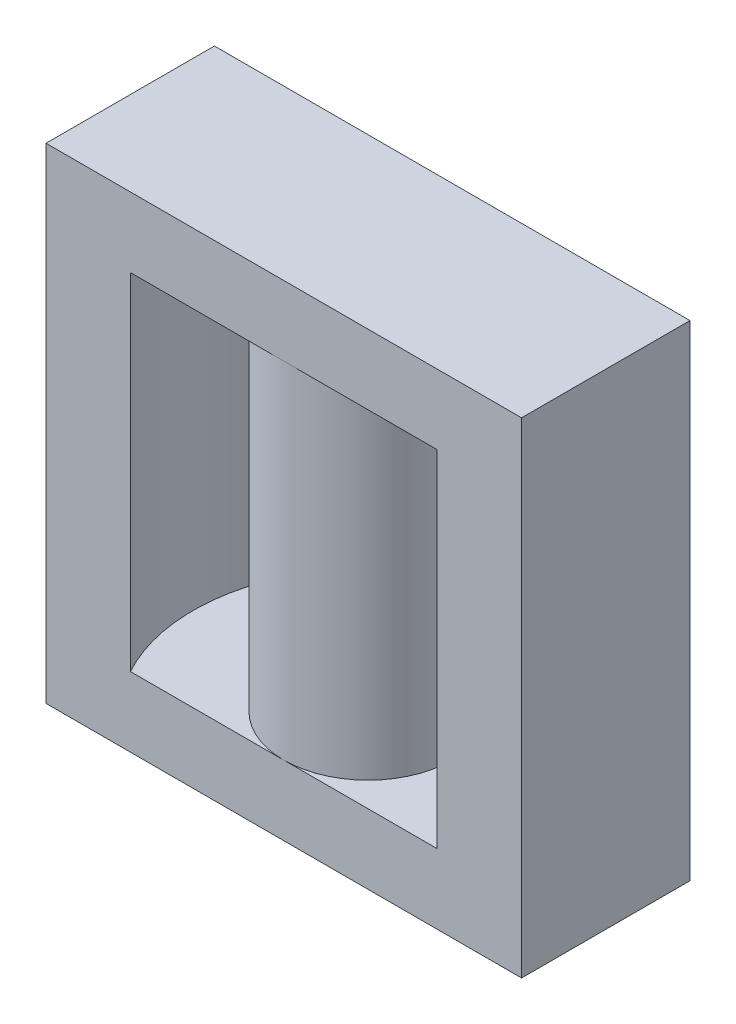
ISO-10303-21;
HEADER;
FILE_DESCRIPTION(('STEP AP214'),'2;1');
FILE_NAME('part.step','',(''),(''),'','','');
FILE_SCHEMA(('AUTOMOTIVE_DESIGN { 1 0 10303 214 1 1 1 1 }'));
ENDSEC;
DATA;
#1=APPLICATION_CONTEXT('core data for automotive mechanical design processes');
#2=APPLICATION_PROTOCOL_DEFINITION('international standard','automotive_design',2000,#1);
#3=PRODUCT_CONTEXT('',#1,'mechanical');
#4=PRODUCT('Part','Part','',(#3));
#5=PRODUCT_RELATED_PRODUCT_CATEGORY('part','',(#4));
#6=PRODUCT_DEFINITION_FORMATION('','',#4);
#7=PRODUCT_DEFINITION_CONTEXT('part definition',#1,'design');
#8=PRODUCT_DEFINITION('design','',#6,#7);
#9=PRODUCT_DEFINITION_SHAPE('','',#8);
#10=(LENGTH_UNIT() NAMED_UNIT(*) SI_UNIT(.MILLI.,.METRE.));
#11=(NAMED_UNIT(*) PLANE_ANGLE_UNIT() SI_UNIT($,.RADIAN.));
#12=(NAMED_UNIT(*) SI_UNIT($,.STERADIAN.) SOLID_ANGLE_UNIT());
#13=UNCERTAINTY_MEASURE_WITH_UNIT(LENGTH_MEASURE(1.E-05),#10,'distance_accuracy_value','');
#14=(GEOMETRIC_REPRESENTATION_CONTEXT(3) GLOBAL_UNCERTAINTY_ASSIGNED_CONTEXT((#13)) GLOBAL_UNIT_ASSIGNED_CONTEXT((#10,
#11,#12)) REPRESENTATION_CONTEXT('',''));
#15=CARTESIAN_POINT('',(0.,0.,0.));
#16=DIRECTION('',(0.,0.,1.));
#17=DIRECTION('',(1.,0.,0.));
#18=AXIS2_PLACEMENT_3D('',#15,#16,#17);
#19=CARTESIAN_POINT('',(0.,55.6,0.));
#20=DIRECTION('',(0.,-1.,0.));
#21=DIRECTION('',(0.,0.,-1.));
#22=AXIS2_PLACEMENT_3D('',#19,#20,#21);
#23=CYLINDRICAL_SURFACE('',#22,20.05);
#24=DIRECTION('',(0.,-1.,0.));
#25=VECTOR('',#24,1.);
#26=CARTESIAN_POINT('',(-17.5749822190522,55.6,9.65));
#27=LINE('',#26,#25);
#28=CARTESIAN_POINT('',(-17.5749822190522,47.6,9.65));
#29=VERTEX_POINT('',#28);
#30=CARTESIAN_POINT('',(-17.5749822190522,8.,9.65));
#31=VERTEX_POINT('',#30);
#32=EDGE_CURVE('E131',#29,#31,#27,.T.);
#33=ORIENTED_EDGE('',*,*,#32,.T.);
#34=CARTESIAN_POINT('',(0.,8.,0.));
#35=DIRECTION('',(0.,-1.,0.));
#36=DIRECTION('',(0.,0.,-1.));
#37=AXIS2_PLACEMENT_3D('',#34,#35,#36);
#38=CIRCLE('',#37,20.05);
#39=CARTESIAN_POINT('',(-17.5749822190522,8.,-9.65));
#40=VERTEX_POINT('',#39);
#41=EDGE_CURVE('E118',#31,#40,#38,.T.);
#42=ORIENTED_EDGE('',*,*,#41,.T.);
#43=DIRECTION('',(0.,-1.,0.));
#44=VECTOR('',#43,1.);
#45=CARTESIAN_POINT('',(-17.5749822190522,55.6,-9.65));
#46=LINE('',#45,#44);
#47=CARTESIAN_POINT('',(-17.5749822190522,47.6,-9.65));
#48=VERTEX_POINT('',#47);
#49=EDGE_CURVE('E128',#48,#40,#46,.T.);
#50=ORIENTED_EDGE('',*,*,#49,.F.);
#51=CARTESIAN_POINT('',(0.,47.6,0.));
#52=DIRECTION('',(0.,1.,0.));
#53=DIRECTION('',(0.,0.,1.));
#54=AXIS2_PLACEMENT_3D('',#51,#52,#53);
#55=CIRCLE('',#54,20.05);
#56=EDGE_CURVE('E162',#48,#29,#55,.T.);
#57=ORIENTED_EDGE('',*,*,#56,.T.);
#58=EDGE_LOOP('',(#33,#42,#50,#57));
#59=FACE_BOUND('',#58,.T.);
#60=ADVANCED_FACE('F38',(#59),#23,.F.);
#61=CARTESIAN_POINT('',(0.,55.6,0.));
#62=DIRECTION('',(0.,-1.,0.));
#63=DIRECTION('',(0.,0.,-1.));
#64=AXIS2_PLACEMENT_3D('',#61,#62,#63);
#65=CYLINDRICAL_SURFACE('',#64,9.65);
#66=CARTESIAN_POINT('',(0.,47.6,0.));
#67=DIRECTION('',(0.,1.,0.));
#68=DIRECTION('',(0.,0.,1.));
#69=AXIS2_PLACEMENT_3D('',#66,#67,#68);
#70=CIRCLE('',#69,9.65);
#71=CARTESIAN_POINT('',(0.,47.6,-9.65));
#72=VERTEX_POINT('',#71);
#73=CARTESIAN_POINT('',(0.,47.6,9.65));
#74=VERTEX_POINT('',#73);
#75=EDGE_CURVE('E139',#72,#74,#70,.F.);
#76=ORIENTED_EDGE('',*,*,#75,.T.);
#77=EDGE_CURVE('E143',#74,#72,#70,.F.);
#78=ORIENTED_EDGE('',*,*,#77,.T.);
#79=EDGE_LOOP('',(#76,#78));
#80=FACE_BOUND('',#79,.T.);
#81=CARTESIAN_POINT('',(0.,8.,0.));
#82=DIRECTION('',(0.,-1.,0.));
#83=DIRECTION('',(0.,0.,-1.));
#84=AXIS2_PLACEMENT_3D('',#81,#82,#83);
#85=CIRCLE('',#84,9.65);
#86=CARTESIAN_POINT('',(0.,8.,-9.65));
#87=VERTEX_POINT('',#86);
#88=CARTESIAN_POINT('',(0.,8.,9.65));
#89=VERTEX_POINT('',#88);
#90=EDGE_CURVE('E133',#87,#89,#85,.T.);
#91=ORIENTED_EDGE('',*,*,#90,.F.);
#92=EDGE_CURVE('E51',#89,#87,#85,.T.);
#93=ORIENTED_EDGE('',*,*,#92,.F.);
#94=EDGE_LOOP('',(#91,#93));
#95=FACE_BOUND('',#94,.T.);
#96=ADVANCED_FACE('F156',(#80,#95),#65,.T.);
#97=CARTESIAN_POINT('',(0.,55.6,0.));
#98=DIRECTION('',(0.,-1.,0.));
#99=DIRECTION('',(0.,0.,-1.));
#100=AXIS2_PLACEMENT_3D('',#97,#98,#99);
#101=CYLINDRICAL_SURFACE('',#100,20.05);
#102=DIRECTION('',(0.,-1.,0.));
#103=VECTOR('',#102,1.);
#104=CARTESIAN_POINT('',(17.5749822190522,55.6,-9.65));
#105=LINE('',#104,#103);
#106=CARTESIAN_POINT('',(17.5749822190522,47.6,-9.65));
#107=VERTEX_POINT('',#106);
#108=CARTESIAN_POINT('',(17.5749822190522,8.,-9.65));
#109=VERTEX_POINT('',#108);
#110=EDGE_CURVE('E59',#107,#109,#105,.T.);
#111=ORIENTED_EDGE('',*,*,#110,.T.);
#112=CARTESIAN_POINT('',(0.,8.,0.));
#113=DIRECTION('',(0.,-1.,0.));
#114=DIRECTION('',(0.,0.,-1.));
#115=AXIS2_PLACEMENT_3D('',#112,#113,#114);
#116=CIRCLE('',#115,20.05);
#117=CARTESIAN_POINT('',(17.5749822190522,8.,9.65));
#118=VERTEX_POINT('',#117);
#119=EDGE_CURVE('E11',#109,#118,#116,.T.);
#120=ORIENTED_EDGE('',*,*,#119,.T.);
#121=DIRECTION('',(0.,-1.,0.));
#122=VECTOR('',#121,1.);
#123=CARTESIAN_POINT('',(17.5749822190522,55.6,9.65));
#124=LINE('',#123,#122);
#125=CARTESIAN_POINT('',(17.5749822190522,47.6,9.65));
#126=VERTEX_POINT('',#125);
#127=EDGE_CURVE('E173',#126,#118,#124,.T.);
#128=ORIENTED_EDGE('',*,*,#127,.F.);
#129=CARTESIAN_POINT('',(0.,47.6,0.));
#130=DIRECTION('',(0.,1.,0.));
#131=DIRECTION('',(0.,0.,1.));
#132=AXIS2_PLACEMENT_3D('',#129,#130,#131);
#133=CIRCLE('',#132,20.05);
#134=EDGE_CURVE('E45',#107,#126,#133,.F.);
#135=ORIENTED_EDGE('',*,*,#134,.F.);
#136=EDGE_LOOP('',(#111,#120,#128,#135));
#137=FACE_BOUND('',#136,.T.);
#138=ADVANCED_FACE('F218',(#137),#101,.F.);
#139=CARTESIAN_POINT('',(0.,47.6,0.));
#140=DIRECTION('',(0.,1.,0.));
#141=DIRECTION('',(0.,0.,1.));
#142=AXIS2_PLACEMENT_3D('',#139,#140,#141);
#143=PLANE('',#142);
#144=ORIENTED_EDGE('',*,*,#77,.F.);
#145=DIRECTION('',(1.,0.,0.));
#146=VECTOR('',#145,1.);
#147=CARTESIAN_POINT('',(-27.25,47.6,9.65));
#148=LINE('',#147,#146);
#149=EDGE_CURVE('E161',#29,#74,#148,.T.);
#150=ORIENTED_EDGE('',*,*,#149,.F.);
#151=ORIENTED_EDGE('',*,*,#56,.F.);
#152=DIRECTION('',(-1.,0.,0.));
#153=VECTOR('',#152,1.);
#154=CARTESIAN_POINT('',(-27.25,47.6,-9.65));
#155=LINE('',#154,#153);
#156=EDGE_CURVE('E138',#72,#48,#155,.T.);
#157=ORIENTED_EDGE('',*,*,#156,.F.);
#158=EDGE_LOOP('',(#144,#150,#151,#157));
#159=FACE_BOUND('',#158,.T.);
#160=ADVANCED_FACE('F160',(#159),#143,.F.);
#161=CARTESIAN_POINT('',(0.,55.6,-9.65));
#162=DIRECTION('',(0.,0.,-1.));
#163=DIRECTION('',(-1.,0.,0.));
#164=AXIS2_PLACEMENT_3D('',#161,#162,#163);
#165=PLANE('',#164);
#166=ORIENTED_EDGE('',*,*,#49,.T.);
#167=DIRECTION('',(1.,0.,0.));
#168=VECTOR('',#167,1.);
#169=CARTESIAN_POINT('',(-27.25,8.,-9.65));
#170=LINE('',#169,#168);
#171=EDGE_CURVE('E114',#40,#87,#170,.T.);
#172=ORIENTED_EDGE('',*,*,#171,.T.);
#173=EDGE_CURVE('E123',#87,#109,#170,.T.);
#174=ORIENTED_EDGE('',*,*,#173,.T.);
#175=ORIENTED_EDGE('',*,*,#110,.F.);
#176=EDGE_CURVE('E163',#107,#72,#155,.T.);
#177=ORIENTED_EDGE('',*,*,#176,.T.);
#178=ORIENTED_EDGE('',*,*,#156,.T.);
#179=EDGE_LOOP('',(#166,#172,#174,#175,#177,#178));
#180=FACE_BOUND('',#179,.T.);
#181=DIRECTION('',(1.,0.,0.));
#182=VECTOR('',#181,1.);
#183=CARTESIAN_POINT('',(0.,0.,-9.65));
#184=LINE('',#183,#182);
#185=CARTESIAN_POINT('',(-27.25,0.,-9.65));
#186=VERTEX_POINT('',#185);
#187=CARTESIAN_POINT('',(27.25,0.,-9.65));
#188=VERTEX_POINT('',#187);
#189=EDGE_CURVE('E178',#186,#188,#184,.T.);
#190=ORIENTED_EDGE('',*,*,#189,.F.);
#191=DIRECTION('',(0.,-1.,0.));
#192=VECTOR('',#191,1.);
#193=CARTESIAN_POINT('',(-27.25,55.6,-9.65));
#194=LINE('',#193,#192);
#195=CARTESIAN_POINT('',(-27.25,55.6,-9.65));
#196=VERTEX_POINT('',#195);
#197=EDGE_CURVE('E140',#196,#186,#194,.T.);
#198=ORIENTED_EDGE('',*,*,#197,.F.);
#199=DIRECTION('',(1.,0.,0.));
#200=VECTOR('',#199,1.);
#201=CARTESIAN_POINT('',(0.,55.6,-9.65));
#202=LINE('',#201,#200);
#203=CARTESIAN_POINT('',(27.25,55.6,-9.65));
#204=VERTEX_POINT('',#203);
#205=EDGE_CURVE('E179',#196,#204,#202,.T.);
#206=ORIENTED_EDGE('',*,*,#205,.T.);
#207=DIRECTION('',(0.,1.,0.));
#208=VECTOR('',#207,1.);
#209=CARTESIAN_POINT('',(27.25,47.6,-9.65));
#210=LINE('',#209,#208);
#211=EDGE_CURVE('E174',#188,#204,#210,.T.);
#212=ORIENTED_EDGE('',*,*,#211,.F.);
#213=EDGE_LOOP('',(#190,#198,#206,#212));
#214=FACE_BOUND('',#213,.T.);
#215=ADVANCED_FACE('F135',(#180,#214),#165,.T.);
#216=CARTESIAN_POINT('',(-27.25,55.6,0.));
#217=DIRECTION('',(1.,0.,0.));
#218=DIRECTION('',(0.,0.,-1.));
#219=AXIS2_PLACEMENT_3D('',#216,#217,#218);
#220=PLANE('',#219);
#221=DIRECTION('',(0.,0.,1.));
#222=VECTOR('',#221,1.);
#223=CARTESIAN_POINT('',(-27.25,0.,0.));
#224=LINE('',#223,#222);
#225=CARTESIAN_POINT('',(-27.25,0.,9.65));
#226=VERTEX_POINT('',#225);
#227=EDGE_CURVE('E189',#186,#226,#224,.T.);
#228=ORIENTED_EDGE('',*,*,#227,.T.);
#229=DIRECTION('',(0.,-1.,0.));
#230=VECTOR('',#229,1.);
#231=CARTESIAN_POINT('',(-27.25,55.6,9.65));
#232=LINE('',#231,#230);
#233=CARTESIAN_POINT('',(-27.25,55.6,9.65));
#234=VERTEX_POINT('',#233);
#235=EDGE_CURVE('E145',#234,#226,#232,.T.);
#236=ORIENTED_EDGE('',*,*,#235,.F.);
#237=DIRECTION('',(0.,0.,1.));
#238=VECTOR('',#237,1.);
#239=CARTESIAN_POINT('',(-27.25,55.6,0.));
#240=LINE('',#239,#238);
#241=EDGE_CURVE('E182',#196,#234,#240,.T.);
#242=ORIENTED_EDGE('',*,*,#241,.F.);
#243=ORIENTED_EDGE('',*,*,#197,.T.);
#244=EDGE_LOOP('',(#228,#236,#242,#243));
#245=FACE_BOUND('',#244,.T.);
#246=ADVANCED_FACE('F203',(#245),#220,.F.);
#247=CARTESIAN_POINT('',(0.,55.6,9.65));
#248=DIRECTION('',(0.,0.,-1.));
#249=DIRECTION('',(-1.,0.,0.));
#250=AXIS2_PLACEMENT_3D('',#247,#248,#249);
#251=PLANE('',#250);
#252=DIRECTION('',(1.,0.,0.));
#253=VECTOR('',#252,1.);
#254=CARTESIAN_POINT('',(0.,0.,9.65));
#255=LINE('',#254,#253);
#256=CARTESIAN_POINT('',(27.25,0.,9.65));
#257=VERTEX_POINT('',#256);
#258=EDGE_CURVE('E183',#226,#257,#255,.T.);
#259=ORIENTED_EDGE('',*,*,#258,.T.);
#260=DIRECTION('',(0.,1.,0.));
#261=VECTOR('',#260,1.);
#262=CARTESIAN_POINT('',(27.25,47.6,9.65));
#263=LINE('',#262,#261);
#264=CARTESIAN_POINT('',(27.25,55.6,9.65));
#265=VERTEX_POINT('',#264);
#266=EDGE_CURVE('E165',#257,#265,#263,.T.);
#267=ORIENTED_EDGE('',*,*,#266,.T.);
#268=DIRECTION('',(1.,0.,0.));
#269=VECTOR('',#268,1.);
#270=CARTESIAN_POINT('',(0.,55.6,9.65));
#271=LINE('',#270,#269);
#272=EDGE_CURVE('E185',#234,#265,#271,.T.);
#273=ORIENTED_EDGE('',*,*,#272,.F.);
#274=ORIENTED_EDGE('',*,*,#235,.T.);
#275=EDGE_LOOP('',(#259,#267,#273,#274));
#276=FACE_BOUND('',#275,.T.);
#277=DIRECTION('',(-1.,0.,0.));
#278=VECTOR('',#277,1.);
#279=CARTESIAN_POINT('',(-27.25,8.,9.65));
#280=LINE('',#279,#278);
#281=EDGE_CURVE('E122',#89,#31,#280,.T.);
#282=ORIENTED_EDGE('',*,*,#281,.T.);
#283=ORIENTED_EDGE('',*,*,#32,.F.);
#284=ORIENTED_EDGE('',*,*,#149,.T.);
#285=EDGE_CURVE('E166',#74,#126,#148,.T.);
#286=ORIENTED_EDGE('',*,*,#285,.T.);
#287=ORIENTED_EDGE('',*,*,#127,.T.);
#288=EDGE_CURVE('E216',#118,#89,#280,.T.);
#289=ORIENTED_EDGE('',*,*,#288,.T.);
#290=EDGE_LOOP('',(#282,#283,#284,#286,#287,#289));
#291=FACE_BOUND('',#290,.T.);
#292=ADVANCED_FACE('F196',(#276,#291),#251,.F.);
#293=CARTESIAN_POINT('',(0.,55.6,0.));
#294=DIRECTION('',(0.,1.,0.));
#295=DIRECTION('',(0.,0.,1.));
#296=AXIS2_PLACEMENT_3D('',#293,#294,#295);
#297=PLANE('',#296);
#298=ORIENTED_EDGE('',*,*,#272,.T.);
#299=DIRECTION('',(0.,0.,-1.));
#300=VECTOR('',#299,1.);
#301=CARTESIAN_POINT('',(27.25,55.6,-9.65));
#302=LINE('',#301,#300);
#303=EDGE_CURVE('E170',#265,#204,#302,.T.);
#304=ORIENTED_EDGE('',*,*,#303,.T.);
#305=ORIENTED_EDGE('',*,*,#205,.F.);
#306=ORIENTED_EDGE('',*,*,#241,.T.);
#307=EDGE_LOOP('',(#298,#304,#305,#306));
#308=FACE_BOUND('',#307,.T.);
#309=ADVANCED_FACE('F266',(#308),#297,.T.);
#310=CARTESIAN_POINT('',(0.,0.,0.));
#311=DIRECTION('',(0.,1.,0.));
#312=DIRECTION('',(0.,0.,1.));
#313=AXIS2_PLACEMENT_3D('',#310,#311,#312);
#314=PLANE('',#313);
#315=ORIENTED_EDGE('',*,*,#189,.T.);
#316=DIRECTION('',(0.,0.,1.));
#317=VECTOR('',#316,1.);
#318=CARTESIAN_POINT('',(27.25,0.,0.));
#319=LINE('',#318,#317);
#320=EDGE_CURVE('E132',#188,#257,#319,.T.);
#321=ORIENTED_EDGE('',*,*,#320,.T.);
#322=ORIENTED_EDGE('',*,*,#258,.F.);
#323=ORIENTED_EDGE('',*,*,#227,.F.);
#324=EDGE_LOOP('',(#315,#321,#322,#323));
#325=FACE_BOUND('',#324,.T.);
#326=ADVANCED_FACE('F207',(#325),#314,.F.);
#327=CARTESIAN_POINT('',(27.25,47.6,-9.65));
#328=DIRECTION('',(1.,0.,0.));
#329=DIRECTION('',(0.,0.,-1.));
#330=AXIS2_PLACEMENT_3D('',#327,#328,#329);
#331=PLANE('',#330);
#332=ORIENTED_EDGE('',*,*,#211,.T.);
#333=ORIENTED_EDGE('',*,*,#303,.F.);
#334=ORIENTED_EDGE('',*,*,#266,.F.);
#335=ORIENTED_EDGE('',*,*,#320,.F.);
#336=EDGE_LOOP('',(#332,#333,#334,#335));
#337=FACE_BOUND('',#336,.T.);
#338=ADVANCED_FACE('F224',(#337),#331,.T.);
#339=ORIENTED_EDGE('',*,*,#176,.F.);
#340=ORIENTED_EDGE('',*,*,#134,.T.);
#341=ORIENTED_EDGE('',*,*,#285,.F.);
#342=ORIENTED_EDGE('',*,*,#75,.F.);
#343=EDGE_LOOP('',(#339,#340,#341,#342));
#344=FACE_BOUND('',#343,.T.);
#345=ADVANCED_FACE('F222',(#344),#143,.F.);
#346=CARTESIAN_POINT('',(0.,8.,0.));
#347=DIRECTION('',(0.,-1.,0.));
#348=DIRECTION('',(0.,0.,-1.));
#349=AXIS2_PLACEMENT_3D('',#346,#347,#348);
#350=PLANE('',#349);
#351=ORIENTED_EDGE('',*,*,#41,.F.);
#352=ORIENTED_EDGE('',*,*,#281,.F.);
#353=ORIENTED_EDGE('',*,*,#92,.T.);
#354=ORIENTED_EDGE('',*,*,#171,.F.);
#355=EDGE_LOOP('',(#351,#352,#353,#354));
#356=FACE_BOUND('',#355,.T.);
#357=ADVANCED_FACE('F116',(#356),#350,.F.);
#358=ORIENTED_EDGE('',*,*,#173,.F.);
#359=ORIENTED_EDGE('',*,*,#90,.T.);
#360=ORIENTED_EDGE('',*,*,#288,.F.);
#361=ORIENTED_EDGE('',*,*,#119,.F.);
#362=EDGE_LOOP('',(#358,#359,#360,#361));
#363=FACE_BOUND('',#362,.T.);
#364=ADVANCED_FACE('F220',(#363),#350,.F.);
#365=CLOSED_SHELL('',(#60,#96,#138,#160,#215,#246,#292,#309,#326,#338,#345,#357,#364));
#366=MANIFOLD_SOLID_BREP('B2',#365);
#367=ADVANCED_BREP_SHAPE_REPRESENTATION('',(#18,#366),#14);
#368=SHAPE_DEFINITION_REPRESENTATION(#9,#367);
ENDSEC;
END-ISO-10303-21;
